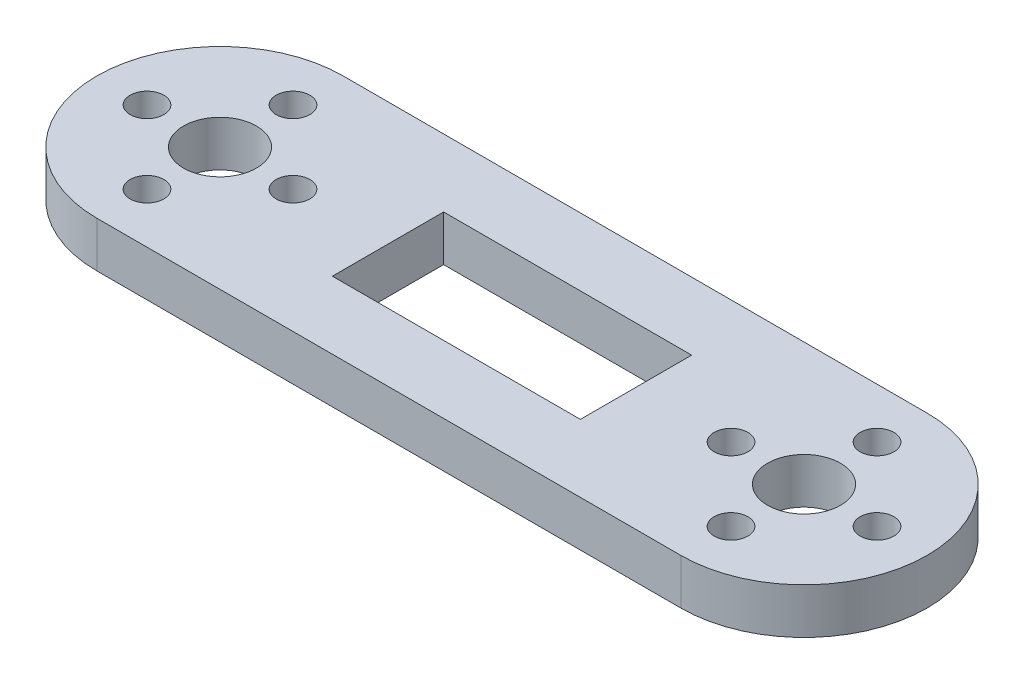
ISO-10303-21;
HEADER;
FILE_DESCRIPTION(('STEP AP214'),'2;1');
FILE_NAME('part.step','',(''),(''),'','','');
FILE_SCHEMA(('AUTOMOTIVE_DESIGN { 1 0 10303 214 1 1 1 1 }'));
ENDSEC;
DATA;
#1=APPLICATION_CONTEXT('core data for automotive mechanical design processes');
#2=APPLICATION_PROTOCOL_DEFINITION('international standard','automotive_design',2000,#1);
#3=PRODUCT_CONTEXT('',#1,'mechanical');
#4=PRODUCT('Part','Part','',(#3));
#5=PRODUCT_RELATED_PRODUCT_CATEGORY('part','',(#4));
#6=PRODUCT_DEFINITION_FORMATION('','',#4);
#7=PRODUCT_DEFINITION_CONTEXT('part definition',#1,'design');
#8=PRODUCT_DEFINITION('design','',#6,#7);
#9=PRODUCT_DEFINITION_SHAPE('','',#8);
#10=(LENGTH_UNIT() NAMED_UNIT(*) SI_UNIT(.MILLI.,.METRE.));
#11=(NAMED_UNIT(*) PLANE_ANGLE_UNIT() SI_UNIT($,.RADIAN.));
#12=(NAMED_UNIT(*) SI_UNIT($,.STERADIAN.) SOLID_ANGLE_UNIT());
#13=UNCERTAINTY_MEASURE_WITH_UNIT(LENGTH_MEASURE(1.E-05),#10,'distance_accuracy_value','');
#14=(GEOMETRIC_REPRESENTATION_CONTEXT(3) GLOBAL_UNCERTAINTY_ASSIGNED_CONTEXT((#13)) GLOBAL_UNIT_ASSIGNED_CONTEXT((#10,
#11,#12)) REPRESENTATION_CONTEXT('',''));
#15=CARTESIAN_POINT('',(0.,0.,0.));
#16=DIRECTION('',(0.,0.,1.));
#17=DIRECTION('',(1.,0.,0.));
#18=AXIS2_PLACEMENT_3D('',#15,#16,#17);
#19=CARTESIAN_POINT('',(0.,5.,0.));
#20=DIRECTION('',(0.,1.,0.));
#21=DIRECTION('',(0.,0.,1.));
#22=AXIS2_PLACEMENT_3D('',#19,#20,#21);
#23=PLANE('',#22);
#24=DIRECTION('',(1.,0.,0.));
#25=VECTOR('',#24,1.);
#26=CARTESIAN_POINT('',(18.411,5.,6.096));
#27=LINE('',#26,#25);
#28=CARTESIAN_POINT('',(45.589,5.,6.096));
#29=VERTEX_POINT('',#28);
#30=CARTESIAN_POINT('',(18.411,5.,6.096));
#31=VERTEX_POINT('',#30);
#32=EDGE_CURVE('E193',#29,#31,#27,.F.);
#33=ORIENTED_EDGE('',*,*,#32,.T.);
#34=DIRECTION('',(0.,0.,1.));
#35=VECTOR('',#34,1.);
#36=CARTESIAN_POINT('',(18.411,5.,-6.096));
#37=LINE('',#36,#35);
#38=CARTESIAN_POINT('',(18.411,5.,-6.096));
#39=VERTEX_POINT('',#38);
#40=EDGE_CURVE('E146',#31,#39,#37,.F.);
#41=ORIENTED_EDGE('',*,*,#40,.T.);
#42=DIRECTION('',(-1.,0.,0.));
#43=VECTOR('',#42,1.);
#44=CARTESIAN_POINT('',(45.589,5.,-6.096));
#45=LINE('',#44,#43);
#46=CARTESIAN_POINT('',(45.589,5.,-6.096));
#47=VERTEX_POINT('',#46);
#48=EDGE_CURVE('E202',#39,#47,#45,.F.);
#49=ORIENTED_EDGE('',*,*,#48,.T.);
#50=DIRECTION('',(0.,0.,-1.));
#51=VECTOR('',#50,1.);
#52=CARTESIAN_POINT('',(45.589,5.,6.096));
#53=LINE('',#52,#51);
#54=EDGE_CURVE('E197',#47,#29,#53,.F.);
#55=ORIENTED_EDGE('',*,*,#54,.T.);
#56=EDGE_LOOP('',(#33,#41,#49,#55));
#57=FACE_BOUND('',#56,.T.);
#58=CARTESIAN_POINT('',(56.,5.,0.));
#59=DIRECTION('',(0.,1.,0.));
#60=DIRECTION('',(0.,0.,1.));
#61=AXIS2_PLACEMENT_3D('',#58,#59,#60);
#62=CIRCLE('',#61,1.85);
#63=CARTESIAN_POINT('',(56.,5.,1.85));
#64=VERTEX_POINT('',#63);
#65=EDGE_CURVE('E143',#64,#64,#62,.F.);
#66=ORIENTED_EDGE('',*,*,#65,.T.);
#67=EDGE_LOOP('',(#66));
#68=FACE_BOUND('',#67,.T.);
#69=CARTESIAN_POINT('',(64.,5.,8.));
#70=DIRECTION('',(0.,1.,0.));
#71=DIRECTION('',(0.,0.,1.));
#72=AXIS2_PLACEMENT_3D('',#69,#70,#71);
#73=CIRCLE('',#72,1.85);
#74=CARTESIAN_POINT('',(64.,5.,9.85));
#75=VERTEX_POINT('',#74);
#76=EDGE_CURVE('E147',#75,#75,#73,.F.);
#77=ORIENTED_EDGE('',*,*,#76,.T.);
#78=EDGE_LOOP('',(#77));
#79=FACE_BOUND('',#78,.T.);
#80=CARTESIAN_POINT('',(72.,5.,0.));
#81=DIRECTION('',(0.,1.,0.));
#82=DIRECTION('',(0.,0.,1.));
#83=AXIS2_PLACEMENT_3D('',#80,#81,#82);
#84=CIRCLE('',#83,1.85);
#85=CARTESIAN_POINT('',(72.,5.,1.85));
#86=VERTEX_POINT('',#85);
#87=EDGE_CURVE('E150',#86,#86,#84,.F.);
#88=ORIENTED_EDGE('',*,*,#87,.T.);
#89=EDGE_LOOP('',(#88));
#90=FACE_BOUND('',#89,.T.);
#91=CARTESIAN_POINT('',(64.,5.,-8.));
#92=DIRECTION('',(0.,1.,0.));
#93=DIRECTION('',(0.,0.,1.));
#94=AXIS2_PLACEMENT_3D('',#91,#92,#93);
#95=CIRCLE('',#94,1.85);
#96=CARTESIAN_POINT('',(64.,5.,-6.15));
#97=VERTEX_POINT('',#96);
#98=EDGE_CURVE('E153',#97,#97,#95,.F.);
#99=ORIENTED_EDGE('',*,*,#98,.T.);
#100=EDGE_LOOP('',(#99));
#101=FACE_BOUND('',#100,.T.);
#102=CARTESIAN_POINT('',(64.,5.,0.));
#103=DIRECTION('',(0.,1.,0.));
#104=DIRECTION('',(0.,0.,1.));
#105=AXIS2_PLACEMENT_3D('',#102,#103,#104);
#106=CIRCLE('',#105,4.);
#107=CARTESIAN_POINT('',(64.,5.,4.));
#108=VERTEX_POINT('',#107);
#109=EDGE_CURVE('E156',#108,#108,#106,.F.);
#110=ORIENTED_EDGE('',*,*,#109,.T.);
#111=EDGE_LOOP('',(#110));
#112=FACE_BOUND('',#111,.T.);
#113=CARTESIAN_POINT('',(-8.,5.,0.));
#114=DIRECTION('',(0.,1.,0.));
#115=DIRECTION('',(0.,0.,1.));
#116=AXIS2_PLACEMENT_3D('',#113,#114,#115);
#117=CIRCLE('',#116,1.85);
#118=CARTESIAN_POINT('',(-8.,5.,1.85));
#119=VERTEX_POINT('',#118);
#120=EDGE_CURVE('E159',#119,#119,#117,.F.);
#121=ORIENTED_EDGE('',*,*,#120,.T.);
#122=EDGE_LOOP('',(#121));
#123=FACE_BOUND('',#122,.T.);
#124=CARTESIAN_POINT('',(0.,5.,8.));
#125=DIRECTION('',(0.,1.,0.));
#126=DIRECTION('',(0.,0.,1.));
#127=AXIS2_PLACEMENT_3D('',#124,#125,#126);
#128=CIRCLE('',#127,1.85);
#129=CARTESIAN_POINT('',(0.,5.,9.85));
#130=VERTEX_POINT('',#129);
#131=EDGE_CURVE('E162',#130,#130,#128,.F.);
#132=ORIENTED_EDGE('',*,*,#131,.T.);
#133=EDGE_LOOP('',(#132));
#134=FACE_BOUND('',#133,.T.);
#135=CARTESIAN_POINT('',(8.,5.,0.));
#136=DIRECTION('',(0.,1.,0.));
#137=DIRECTION('',(0.,0.,1.));
#138=AXIS2_PLACEMENT_3D('',#135,#136,#137);
#139=CIRCLE('',#138,1.85);
#140=CARTESIAN_POINT('',(8.,5.,1.85));
#141=VERTEX_POINT('',#140);
#142=EDGE_CURVE('E165',#141,#141,#139,.F.);
#143=ORIENTED_EDGE('',*,*,#142,.T.);
#144=EDGE_LOOP('',(#143));
#145=FACE_BOUND('',#144,.T.);
#146=CARTESIAN_POINT('',(0.,5.,-8.));
#147=DIRECTION('',(0.,1.,0.));
#148=DIRECTION('',(0.,0.,1.));
#149=AXIS2_PLACEMENT_3D('',#146,#147,#148);
#150=CIRCLE('',#149,1.85);
#151=CARTESIAN_POINT('',(0.,5.,-6.15));
#152=VERTEX_POINT('',#151);
#153=EDGE_CURVE('E168',#152,#152,#150,.F.);
#154=ORIENTED_EDGE('',*,*,#153,.T.);
#155=EDGE_LOOP('',(#154));
#156=FACE_BOUND('',#155,.T.);
#157=CARTESIAN_POINT('',(0.,5.,0.));
#158=DIRECTION('',(0.,1.,0.));
#159=DIRECTION('',(0.,0.,1.));
#160=AXIS2_PLACEMENT_3D('',#157,#158,#159);
#161=CIRCLE('',#160,4.);
#162=CARTESIAN_POINT('',(0.,5.,4.));
#163=VERTEX_POINT('',#162);
#164=EDGE_CURVE('E171',#163,#163,#161,.F.);
#165=ORIENTED_EDGE('',*,*,#164,.T.);
#166=EDGE_LOOP('',(#165));
#167=FACE_BOUND('',#166,.T.);
#168=DIRECTION('',(-1.,0.,0.));
#169=VECTOR('',#168,1.);
#170=CARTESIAN_POINT('',(64.,5.,-13.5));
#171=LINE('',#170,#169);
#172=CARTESIAN_POINT('',(0.,5.,-13.5));
#173=VERTEX_POINT('',#172);
#174=CARTESIAN_POINT('',(64.,5.,-13.5));
#175=VERTEX_POINT('',#174);
#176=EDGE_CURVE('E90',#173,#175,#171,.F.);
#177=ORIENTED_EDGE('',*,*,#176,.F.);
#178=CARTESIAN_POINT('',(0.,5.,0.));
#179=DIRECTION('',(0.,1.,0.));
#180=DIRECTION('',(0.,0.,1.));
#181=AXIS2_PLACEMENT_3D('',#178,#179,#180);
#182=CIRCLE('',#181,13.5);
#183=CARTESIAN_POINT('',(0.,5.,13.5));
#184=VERTEX_POINT('',#183);
#185=EDGE_CURVE('E18',#184,#173,#182,.F.);
#186=ORIENTED_EDGE('',*,*,#185,.F.);
#187=DIRECTION('',(1.,0.,0.));
#188=VECTOR('',#187,1.);
#189=CARTESIAN_POINT('',(0.,5.,13.5));
#190=LINE('',#189,#188);
#191=CARTESIAN_POINT('',(64.,5.,13.5));
#192=VERTEX_POINT('',#191);
#193=EDGE_CURVE('E77',#192,#184,#190,.F.);
#194=ORIENTED_EDGE('',*,*,#193,.F.);
#195=CARTESIAN_POINT('',(64.,5.,0.));
#196=DIRECTION('',(0.,1.,0.));
#197=DIRECTION('',(0.,0.,1.));
#198=AXIS2_PLACEMENT_3D('',#195,#196,#197);
#199=CIRCLE('',#198,13.5);
#200=EDGE_CURVE('E97',#175,#192,#199,.F.);
#201=ORIENTED_EDGE('',*,*,#200,.F.);
#202=EDGE_LOOP('',(#177,#186,#194,#201));
#203=FACE_BOUND('',#202,.T.);
#204=ADVANCED_FACE('F15',(#57,#68,#79,#90,#101,#112,#123,#134,#145,#156,#167,#203),#23,.T.);
#205=CARTESIAN_POINT('',(0.,0.,0.));
#206=DIRECTION('',(0.,1.,0.));
#207=DIRECTION('',(0.,0.,1.));
#208=AXIS2_PLACEMENT_3D('',#205,#206,#207);
#209=CYLINDRICAL_SURFACE('',#208,13.5);
#210=DIRECTION('',(0.,1.,0.));
#211=VECTOR('',#210,1.);
#212=CARTESIAN_POINT('',(0.,0.,-13.5));
#213=LINE('',#212,#211);
#214=CARTESIAN_POINT('',(0.,0.,-13.5));
#215=VERTEX_POINT('',#214);
#216=EDGE_CURVE('E103',#215,#173,#213,.T.);
#217=ORIENTED_EDGE('',*,*,#216,.F.);
#218=CARTESIAN_POINT('',(0.,0.,0.));
#219=DIRECTION('',(0.,1.,0.));
#220=DIRECTION('',(0.,0.,1.));
#221=AXIS2_PLACEMENT_3D('',#218,#219,#220);
#222=CIRCLE('',#221,13.5);
#223=CARTESIAN_POINT('',(0.,0.,13.5));
#224=VERTEX_POINT('',#223);
#225=EDGE_CURVE('E96',#215,#224,#222,.T.);
#226=ORIENTED_EDGE('',*,*,#225,.T.);
#227=DIRECTION('',(0.,1.,0.));
#228=VECTOR('',#227,1.);
#229=CARTESIAN_POINT('',(0.,0.,13.5));
#230=LINE('',#229,#228);
#231=EDGE_CURVE('E82',#184,#224,#230,.F.);
#232=ORIENTED_EDGE('',*,*,#231,.F.);
#233=ORIENTED_EDGE('',*,*,#185,.T.);
#234=EDGE_LOOP('',(#217,#226,#232,#233));
#235=FACE_BOUND('',#234,.T.);
#236=ADVANCED_FACE('F95',(#235),#209,.T.);
#237=CARTESIAN_POINT('',(0.,0.,13.5));
#238=DIRECTION('',(0.,0.,1.));
#239=DIRECTION('',(1.,0.,0.));
#240=AXIS2_PLACEMENT_3D('',#237,#238,#239);
#241=PLANE('',#240);
#242=ORIENTED_EDGE('',*,*,#231,.T.);
#243=DIRECTION('',(1.,0.,0.));
#244=VECTOR('',#243,1.);
#245=CARTESIAN_POINT('',(0.,0.,13.5));
#246=LINE('',#245,#244);
#247=CARTESIAN_POINT('',(64.,0.,13.5));
#248=VERTEX_POINT('',#247);
#249=EDGE_CURVE('E140',#224,#248,#246,.T.);
#250=ORIENTED_EDGE('',*,*,#249,.T.);
#251=DIRECTION('',(0.,1.,0.));
#252=VECTOR('',#251,1.);
#253=CARTESIAN_POINT('',(64.,0.,13.5));
#254=LINE('',#253,#252);
#255=EDGE_CURVE('E84',#192,#248,#254,.F.);
#256=ORIENTED_EDGE('',*,*,#255,.F.);
#257=ORIENTED_EDGE('',*,*,#193,.T.);
#258=EDGE_LOOP('',(#242,#250,#256,#257));
#259=FACE_BOUND('',#258,.T.);
#260=ADVANCED_FACE('F79',(#259),#241,.T.);
#261=CARTESIAN_POINT('',(64.,0.,0.));
#262=DIRECTION('',(0.,1.,0.));
#263=DIRECTION('',(0.,0.,1.));
#264=AXIS2_PLACEMENT_3D('',#261,#262,#263);
#265=CYLINDRICAL_SURFACE('',#264,13.5);
#266=ORIENTED_EDGE('',*,*,#255,.T.);
#267=CARTESIAN_POINT('',(64.,0.,0.));
#268=DIRECTION('',(0.,1.,0.));
#269=DIRECTION('',(0.,0.,1.));
#270=AXIS2_PLACEMENT_3D('',#267,#268,#269);
#271=CIRCLE('',#270,13.5);
#272=CARTESIAN_POINT('',(64.,0.,-13.5));
#273=VERTEX_POINT('',#272);
#274=EDGE_CURVE('E137',#248,#273,#271,.T.);
#275=ORIENTED_EDGE('',*,*,#274,.T.);
#276=DIRECTION('',(0.,1.,0.));
#277=VECTOR('',#276,1.);
#278=CARTESIAN_POINT('',(64.,0.,-13.5));
#279=LINE('',#278,#277);
#280=EDGE_CURVE('E102',#175,#273,#279,.F.);
#281=ORIENTED_EDGE('',*,*,#280,.F.);
#282=ORIENTED_EDGE('',*,*,#200,.T.);
#283=EDGE_LOOP('',(#266,#275,#281,#282));
#284=FACE_BOUND('',#283,.T.);
#285=ADVANCED_FACE('F184',(#284),#265,.T.);
#286=CARTESIAN_POINT('',(64.,0.,-13.5));
#287=DIRECTION('',(0.,0.,-1.));
#288=DIRECTION('',(-1.,0.,0.));
#289=AXIS2_PLACEMENT_3D('',#286,#287,#288);
#290=PLANE('',#289);
#291=ORIENTED_EDGE('',*,*,#280,.T.);
#292=DIRECTION('',(1.,0.,0.));
#293=VECTOR('',#292,1.);
#294=CARTESIAN_POINT('',(0.,0.,-13.5));
#295=LINE('',#294,#293);
#296=EDGE_CURVE('E136',#273,#215,#295,.F.);
#297=ORIENTED_EDGE('',*,*,#296,.T.);
#298=ORIENTED_EDGE('',*,*,#216,.T.);
#299=ORIENTED_EDGE('',*,*,#176,.T.);
#300=EDGE_LOOP('',(#291,#297,#298,#299));
#301=FACE_BOUND('',#300,.T.);
#302=ADVANCED_FACE('F280',(#301),#290,.T.);
#303=CARTESIAN_POINT('',(0.,0.,0.));
#304=DIRECTION('',(0.,1.,0.));
#305=DIRECTION('',(0.,0.,1.));
#306=AXIS2_PLACEMENT_3D('',#303,#304,#305);
#307=CYLINDRICAL_SURFACE('',#306,4.);
#308=CARTESIAN_POINT('',(0.,0.,0.));
#309=DIRECTION('',(0.,1.,0.));
#310=DIRECTION('',(0.,0.,1.));
#311=AXIS2_PLACEMENT_3D('',#308,#309,#310);
#312=CIRCLE('',#311,4.);
#313=CARTESIAN_POINT('',(0.,0.,4.));
#314=VERTEX_POINT('',#313);
#315=EDGE_CURVE('E133',#314,#314,#312,.F.);
#316=ORIENTED_EDGE('',*,*,#315,.T.);
#317=EDGE_LOOP('',(#316));
#318=FACE_BOUND('',#317,.T.);
#319=ORIENTED_EDGE('',*,*,#164,.F.);
#320=EDGE_LOOP('',(#319));
#321=FACE_BOUND('',#320,.T.);
#322=ADVANCED_FACE('F276',(#318,#321),#307,.F.);
#323=CARTESIAN_POINT('',(0.,0.,-8.));
#324=DIRECTION('',(0.,1.,0.));
#325=DIRECTION('',(0.,0.,1.));
#326=AXIS2_PLACEMENT_3D('',#323,#324,#325);
#327=CYLINDRICAL_SURFACE('',#326,1.85);
#328=CARTESIAN_POINT('',(0.,0.,-8.));
#329=DIRECTION('',(0.,1.,0.));
#330=DIRECTION('',(0.,0.,1.));
#331=AXIS2_PLACEMENT_3D('',#328,#329,#330);
#332=CIRCLE('',#331,1.85);
#333=CARTESIAN_POINT('',(0.,0.,-6.15));
#334=VERTEX_POINT('',#333);
#335=EDGE_CURVE('E130',#334,#334,#332,.F.);
#336=ORIENTED_EDGE('',*,*,#335,.T.);
#337=EDGE_LOOP('',(#336));
#338=FACE_BOUND('',#337,.T.);
#339=ORIENTED_EDGE('',*,*,#153,.F.);
#340=EDGE_LOOP('',(#339));
#341=FACE_BOUND('',#340,.T.);
#342=ADVANCED_FACE('F272',(#338,#341),#327,.F.);
#343=CARTESIAN_POINT('',(8.,0.,0.));
#344=DIRECTION('',(0.,1.,0.));
#345=DIRECTION('',(0.,0.,1.));
#346=AXIS2_PLACEMENT_3D('',#343,#344,#345);
#347=CYLINDRICAL_SURFACE('',#346,1.85);
#348=CARTESIAN_POINT('',(8.,0.,0.));
#349=DIRECTION('',(0.,1.,0.));
#350=DIRECTION('',(0.,0.,1.));
#351=AXIS2_PLACEMENT_3D('',#348,#349,#350);
#352=CIRCLE('',#351,1.85);
#353=CARTESIAN_POINT('',(8.,0.,1.85));
#354=VERTEX_POINT('',#353);
#355=EDGE_CURVE('E127',#354,#354,#352,.F.);
#356=ORIENTED_EDGE('',*,*,#355,.T.);
#357=EDGE_LOOP('',(#356));
#358=FACE_BOUND('',#357,.T.);
#359=ORIENTED_EDGE('',*,*,#142,.F.);
#360=EDGE_LOOP('',(#359));
#361=FACE_BOUND('',#360,.T.);
#362=ADVANCED_FACE('F268',(#358,#361),#347,.F.);
#363=CARTESIAN_POINT('',(0.,0.,8.));
#364=DIRECTION('',(0.,1.,0.));
#365=DIRECTION('',(0.,0.,1.));
#366=AXIS2_PLACEMENT_3D('',#363,#364,#365);
#367=CYLINDRICAL_SURFACE('',#366,1.85);
#368=CARTESIAN_POINT('',(0.,0.,8.));
#369=DIRECTION('',(0.,1.,0.));
#370=DIRECTION('',(0.,0.,1.));
#371=AXIS2_PLACEMENT_3D('',#368,#369,#370);
#372=CIRCLE('',#371,1.85);
#373=CARTESIAN_POINT('',(0.,0.,9.85));
#374=VERTEX_POINT('',#373);
#375=EDGE_CURVE('E124',#374,#374,#372,.F.);
#376=ORIENTED_EDGE('',*,*,#375,.T.);
#377=EDGE_LOOP('',(#376));
#378=FACE_BOUND('',#377,.T.);
#379=ORIENTED_EDGE('',*,*,#131,.F.);
#380=EDGE_LOOP('',(#379));
#381=FACE_BOUND('',#380,.T.);
#382=ADVANCED_FACE('F264',(#378,#381),#367,.F.);
#383=CARTESIAN_POINT('',(-8.,0.,0.));
#384=DIRECTION('',(0.,1.,0.));
#385=DIRECTION('',(0.,0.,1.));
#386=AXIS2_PLACEMENT_3D('',#383,#384,#385);
#387=CYLINDRICAL_SURFACE('',#386,1.85);
#388=CARTESIAN_POINT('',(-8.,0.,0.));
#389=DIRECTION('',(0.,1.,0.));
#390=DIRECTION('',(0.,0.,1.));
#391=AXIS2_PLACEMENT_3D('',#388,#389,#390);
#392=CIRCLE('',#391,1.85);
#393=CARTESIAN_POINT('',(-8.,0.,1.85));
#394=VERTEX_POINT('',#393);
#395=EDGE_CURVE('E121',#394,#394,#392,.F.);
#396=ORIENTED_EDGE('',*,*,#395,.T.);
#397=EDGE_LOOP('',(#396));
#398=FACE_BOUND('',#397,.T.);
#399=ORIENTED_EDGE('',*,*,#120,.F.);
#400=EDGE_LOOP('',(#399));
#401=FACE_BOUND('',#400,.T.);
#402=ADVANCED_FACE('F260',(#398,#401),#387,.F.);
#403=CARTESIAN_POINT('',(64.,0.,0.));
#404=DIRECTION('',(0.,1.,0.));
#405=DIRECTION('',(0.,0.,1.));
#406=AXIS2_PLACEMENT_3D('',#403,#404,#405);
#407=CYLINDRICAL_SURFACE('',#406,4.);
#408=ORIENTED_EDGE('',*,*,#109,.F.);
#409=EDGE_LOOP('',(#408));
#410=FACE_BOUND('',#409,.T.);
#411=CARTESIAN_POINT('',(64.,0.,0.));
#412=DIRECTION('',(0.,1.,0.));
#413=DIRECTION('',(0.,0.,1.));
#414=AXIS2_PLACEMENT_3D('',#411,#412,#413);
#415=CIRCLE('',#414,4.);
#416=CARTESIAN_POINT('',(64.,0.,4.));
#417=VERTEX_POINT('',#416);
#418=EDGE_CURVE('E118',#417,#417,#415,.F.);
#419=ORIENTED_EDGE('',*,*,#418,.T.);
#420=EDGE_LOOP('',(#419));
#421=FACE_BOUND('',#420,.T.);
#422=ADVANCED_FACE('F256',(#410,#421),#407,.F.);
#423=CARTESIAN_POINT('',(64.,0.,-8.));
#424=DIRECTION('',(0.,1.,0.));
#425=DIRECTION('',(0.,0.,1.));
#426=AXIS2_PLACEMENT_3D('',#423,#424,#425);
#427=CYLINDRICAL_SURFACE('',#426,1.85);
#428=ORIENTED_EDGE('',*,*,#98,.F.);
#429=EDGE_LOOP('',(#428));
#430=FACE_BOUND('',#429,.T.);
#431=CARTESIAN_POINT('',(64.,0.,-8.));
#432=DIRECTION('',(0.,1.,0.));
#433=DIRECTION('',(0.,0.,1.));
#434=AXIS2_PLACEMENT_3D('',#431,#432,#433);
#435=CIRCLE('',#434,1.85);
#436=CARTESIAN_POINT('',(64.,0.,-6.15));
#437=VERTEX_POINT('',#436);
#438=EDGE_CURVE('E115',#437,#437,#435,.F.);
#439=ORIENTED_EDGE('',*,*,#438,.T.);
#440=EDGE_LOOP('',(#439));
#441=FACE_BOUND('',#440,.T.);
#442=ADVANCED_FACE('F252',(#430,#441),#427,.F.);
#443=CARTESIAN_POINT('',(72.,0.,0.));
#444=DIRECTION('',(0.,1.,0.));
#445=DIRECTION('',(0.,0.,1.));
#446=AXIS2_PLACEMENT_3D('',#443,#444,#445);
#447=CYLINDRICAL_SURFACE('',#446,1.85);
#448=ORIENTED_EDGE('',*,*,#87,.F.);
#449=EDGE_LOOP('',(#448));
#450=FACE_BOUND('',#449,.T.);
#451=CARTESIAN_POINT('',(72.,0.,0.));
#452=DIRECTION('',(0.,1.,0.));
#453=DIRECTION('',(0.,0.,1.));
#454=AXIS2_PLACEMENT_3D('',#451,#452,#453);
#455=CIRCLE('',#454,1.85);
#456=CARTESIAN_POINT('',(72.,0.,1.85));
#457=VERTEX_POINT('',#456);
#458=EDGE_CURVE('E112',#457,#457,#455,.F.);
#459=ORIENTED_EDGE('',*,*,#458,.T.);
#460=EDGE_LOOP('',(#459));
#461=FACE_BOUND('',#460,.T.);
#462=ADVANCED_FACE('F248',(#450,#461),#447,.F.);
#463=CARTESIAN_POINT('',(64.,0.,8.));
#464=DIRECTION('',(0.,1.,0.));
#465=DIRECTION('',(0.,0.,1.));
#466=AXIS2_PLACEMENT_3D('',#463,#464,#465);
#467=CYLINDRICAL_SURFACE('',#466,1.85);
#468=ORIENTED_EDGE('',*,*,#76,.F.);
#469=EDGE_LOOP('',(#468));
#470=FACE_BOUND('',#469,.T.);
#471=CARTESIAN_POINT('',(64.,0.,8.));
#472=DIRECTION('',(0.,1.,0.));
#473=DIRECTION('',(0.,0.,1.));
#474=AXIS2_PLACEMENT_3D('',#471,#472,#473);
#475=CIRCLE('',#474,1.85);
#476=CARTESIAN_POINT('',(64.,0.,9.85));
#477=VERTEX_POINT('',#476);
#478=EDGE_CURVE('E109',#477,#477,#475,.F.);
#479=ORIENTED_EDGE('',*,*,#478,.T.);
#480=EDGE_LOOP('',(#479));
#481=FACE_BOUND('',#480,.T.);
#482=ADVANCED_FACE('F244',(#470,#481),#467,.F.);
#483=CARTESIAN_POINT('',(56.,0.,0.));
#484=DIRECTION('',(0.,1.,0.));
#485=DIRECTION('',(0.,0.,1.));
#486=AXIS2_PLACEMENT_3D('',#483,#484,#485);
#487=CYLINDRICAL_SURFACE('',#486,1.85);
#488=ORIENTED_EDGE('',*,*,#65,.F.);
#489=EDGE_LOOP('',(#488));
#490=FACE_BOUND('',#489,.T.);
#491=CARTESIAN_POINT('',(56.,0.,0.));
#492=DIRECTION('',(0.,1.,0.));
#493=DIRECTION('',(0.,0.,1.));
#494=AXIS2_PLACEMENT_3D('',#491,#492,#493);
#495=CIRCLE('',#494,1.85);
#496=CARTESIAN_POINT('',(56.,0.,1.85));
#497=VERTEX_POINT('',#496);
#498=EDGE_CURVE('E105',#497,#497,#495,.F.);
#499=ORIENTED_EDGE('',*,*,#498,.T.);
#500=EDGE_LOOP('',(#499));
#501=FACE_BOUND('',#500,.T.);
#502=ADVANCED_FACE('F241',(#490,#501),#487,.F.);
#503=CARTESIAN_POINT('',(18.411,5.,-6.096));
#504=DIRECTION('',(-1.,0.,0.));
#505=DIRECTION('',(0.,0.,1.));
#506=AXIS2_PLACEMENT_3D('',#503,#504,#505);
#507=PLANE('',#506);
#508=ORIENTED_EDGE('',*,*,#40,.F.);
#509=DIRECTION('',(0.,1.,0.));
#510=VECTOR('',#509,1.);
#511=CARTESIAN_POINT('',(18.411,5.,6.096));
#512=LINE('',#511,#510);
#513=CARTESIAN_POINT('',(18.411,0.,6.096));
#514=VERTEX_POINT('',#513);
#515=EDGE_CURVE('E142',#31,#514,#512,.F.);
#516=ORIENTED_EDGE('',*,*,#515,.T.);
#517=DIRECTION('',(0.,0.,1.));
#518=VECTOR('',#517,1.);
#519=CARTESIAN_POINT('',(18.411,0.,0.));
#520=LINE('',#519,#518);
#521=CARTESIAN_POINT('',(18.411,0.,-6.096));
#522=VERTEX_POINT('',#521);
#523=EDGE_CURVE('E108',#514,#522,#520,.F.);
#524=ORIENTED_EDGE('',*,*,#523,.T.);
#525=DIRECTION('',(0.,1.,0.));
#526=VECTOR('',#525,1.);
#527=CARTESIAN_POINT('',(18.411,5.,-6.096));
#528=LINE('',#527,#526);
#529=EDGE_CURVE('E203',#522,#39,#528,.T.);
#530=ORIENTED_EDGE('',*,*,#529,.T.);
#531=EDGE_LOOP('',(#508,#516,#524,#530));
#532=FACE_BOUND('',#531,.T.);
#533=ADVANCED_FACE('F225',(#532),#507,.F.);
#534=CARTESIAN_POINT('',(45.589,5.,-6.096));
#535=DIRECTION('',(0.,0.,-1.));
#536=DIRECTION('',(-1.,0.,0.));
#537=AXIS2_PLACEMENT_3D('',#534,#535,#536);
#538=PLANE('',#537);
#539=ORIENTED_EDGE('',*,*,#48,.F.);
#540=ORIENTED_EDGE('',*,*,#529,.F.);
#541=DIRECTION('',(1.,0.,0.));
#542=VECTOR('',#541,1.);
#543=CARTESIAN_POINT('',(0.,0.,-6.096));
#544=LINE('',#543,#542);
#545=CARTESIAN_POINT('',(45.589,0.,-6.096));
#546=VERTEX_POINT('',#545);
#547=EDGE_CURVE('E216',#522,#546,#544,.T.);
#548=ORIENTED_EDGE('',*,*,#547,.T.);
#549=DIRECTION('',(0.,1.,0.));
#550=VECTOR('',#549,1.);
#551=CARTESIAN_POINT('',(45.589,5.,-6.096));
#552=LINE('',#551,#550);
#553=EDGE_CURVE('E199',#546,#47,#552,.T.);
#554=ORIENTED_EDGE('',*,*,#553,.T.);
#555=EDGE_LOOP('',(#539,#540,#548,#554));
#556=FACE_BOUND('',#555,.T.);
#557=ADVANCED_FACE('F213',(#556),#538,.F.);
#558=CARTESIAN_POINT('',(45.589,5.,6.096));
#559=DIRECTION('',(1.,0.,0.));
#560=DIRECTION('',(0.,0.,-1.));
#561=AXIS2_PLACEMENT_3D('',#558,#559,#560);
#562=PLANE('',#561);
#563=ORIENTED_EDGE('',*,*,#54,.F.);
#564=ORIENTED_EDGE('',*,*,#553,.F.);
#565=DIRECTION('',(0.,0.,1.));
#566=VECTOR('',#565,1.);
#567=CARTESIAN_POINT('',(45.589,0.,0.));
#568=LINE('',#567,#566);
#569=CARTESIAN_POINT('',(45.589,0.,6.096));
#570=VERTEX_POINT('',#569);
#571=EDGE_CURVE('E24',#546,#570,#568,.T.);
#572=ORIENTED_EDGE('',*,*,#571,.T.);
#573=DIRECTION('',(0.,1.,0.));
#574=VECTOR('',#573,1.);
#575=CARTESIAN_POINT('',(45.589,5.,6.096));
#576=LINE('',#575,#574);
#577=EDGE_CURVE('E32',#570,#29,#576,.T.);
#578=ORIENTED_EDGE('',*,*,#577,.T.);
#579=EDGE_LOOP('',(#563,#564,#572,#578));
#580=FACE_BOUND('',#579,.T.);
#581=ADVANCED_FACE('F220',(#580),#562,.F.);
#582=CARTESIAN_POINT('',(18.411,5.,6.096));
#583=DIRECTION('',(0.,0.,1.));
#584=DIRECTION('',(1.,0.,0.));
#585=AXIS2_PLACEMENT_3D('',#582,#583,#584);
#586=PLANE('',#585);
#587=ORIENTED_EDGE('',*,*,#32,.F.);
#588=ORIENTED_EDGE('',*,*,#577,.F.);
#589=DIRECTION('',(1.,0.,0.));
#590=VECTOR('',#589,1.);
#591=CARTESIAN_POINT('',(0.,0.,6.096));
#592=LINE('',#591,#590);
#593=EDGE_CURVE('E10',#570,#514,#592,.F.);
#594=ORIENTED_EDGE('',*,*,#593,.T.);
#595=ORIENTED_EDGE('',*,*,#515,.F.);
#596=EDGE_LOOP('',(#587,#588,#594,#595));
#597=FACE_BOUND('',#596,.T.);
#598=ADVANCED_FACE('F226',(#597),#586,.F.);
#599=CARTESIAN_POINT('',(0.,0.,0.));
#600=DIRECTION('',(0.,1.,0.));
#601=DIRECTION('',(0.,0.,1.));
#602=AXIS2_PLACEMENT_3D('',#599,#600,#601);
#603=PLANE('',#602);
#604=ORIENTED_EDGE('',*,*,#571,.F.);
#605=ORIENTED_EDGE('',*,*,#547,.F.);
#606=ORIENTED_EDGE('',*,*,#523,.F.);
#607=ORIENTED_EDGE('',*,*,#593,.F.);
#608=EDGE_LOOP('',(#604,#605,#606,#607));
#609=FACE_BOUND('',#608,.T.);
#610=ORIENTED_EDGE('',*,*,#498,.F.);
#611=EDGE_LOOP('',(#610));
#612=FACE_BOUND('',#611,.T.);
#613=ORIENTED_EDGE('',*,*,#478,.F.);
#614=EDGE_LOOP('',(#613));
#615=FACE_BOUND('',#614,.T.);
#616=ORIENTED_EDGE('',*,*,#458,.F.);
#617=EDGE_LOOP('',(#616));
#618=FACE_BOUND('',#617,.T.);
#619=ORIENTED_EDGE('',*,*,#438,.F.);
#620=EDGE_LOOP('',(#619));
#621=FACE_BOUND('',#620,.T.);
#622=ORIENTED_EDGE('',*,*,#418,.F.);
#623=EDGE_LOOP('',(#622));
#624=FACE_BOUND('',#623,.T.);
#625=ORIENTED_EDGE('',*,*,#395,.F.);
#626=EDGE_LOOP('',(#625));
#627=FACE_BOUND('',#626,.T.);
#628=ORIENTED_EDGE('',*,*,#375,.F.);
#629=EDGE_LOOP('',(#628));
#630=FACE_BOUND('',#629,.T.);
#631=ORIENTED_EDGE('',*,*,#355,.F.);
#632=EDGE_LOOP('',(#631));
#633=FACE_BOUND('',#632,.T.);
#634=ORIENTED_EDGE('',*,*,#335,.F.);
#635=EDGE_LOOP('',(#634));
#636=FACE_BOUND('',#635,.T.);
#637=ORIENTED_EDGE('',*,*,#315,.F.);
#638=EDGE_LOOP('',(#637));
#639=FACE_BOUND('',#638,.T.);
#640=ORIENTED_EDGE('',*,*,#274,.F.);
#641=ORIENTED_EDGE('',*,*,#249,.F.);
#642=ORIENTED_EDGE('',*,*,#225,.F.);
#643=ORIENTED_EDGE('',*,*,#296,.F.);
#644=EDGE_LOOP('',(#640,#641,#642,#643));
#645=FACE_BOUND('',#644,.T.);
#646=ADVANCED_FACE('F186',(#609,#612,#615,#618,#621,#624,#627,#630,#633,#636,#639,#645),#603,.F.);
#647=CLOSED_SHELL('',(#204,#236,#260,#285,#302,#322,#342,#362,#382,#402,#422,#442,#462,#482,
#502,#533,#557,#581,#598,#646));
#648=MANIFOLD_SOLID_BREP('B1',#647);
#649=ADVANCED_BREP_SHAPE_REPRESENTATION('',(#18,#648),#14);
#650=SHAPE_DEFINITION_REPRESENTATION(#9,#649);
ENDSEC;
END-ISO-10303-21;
